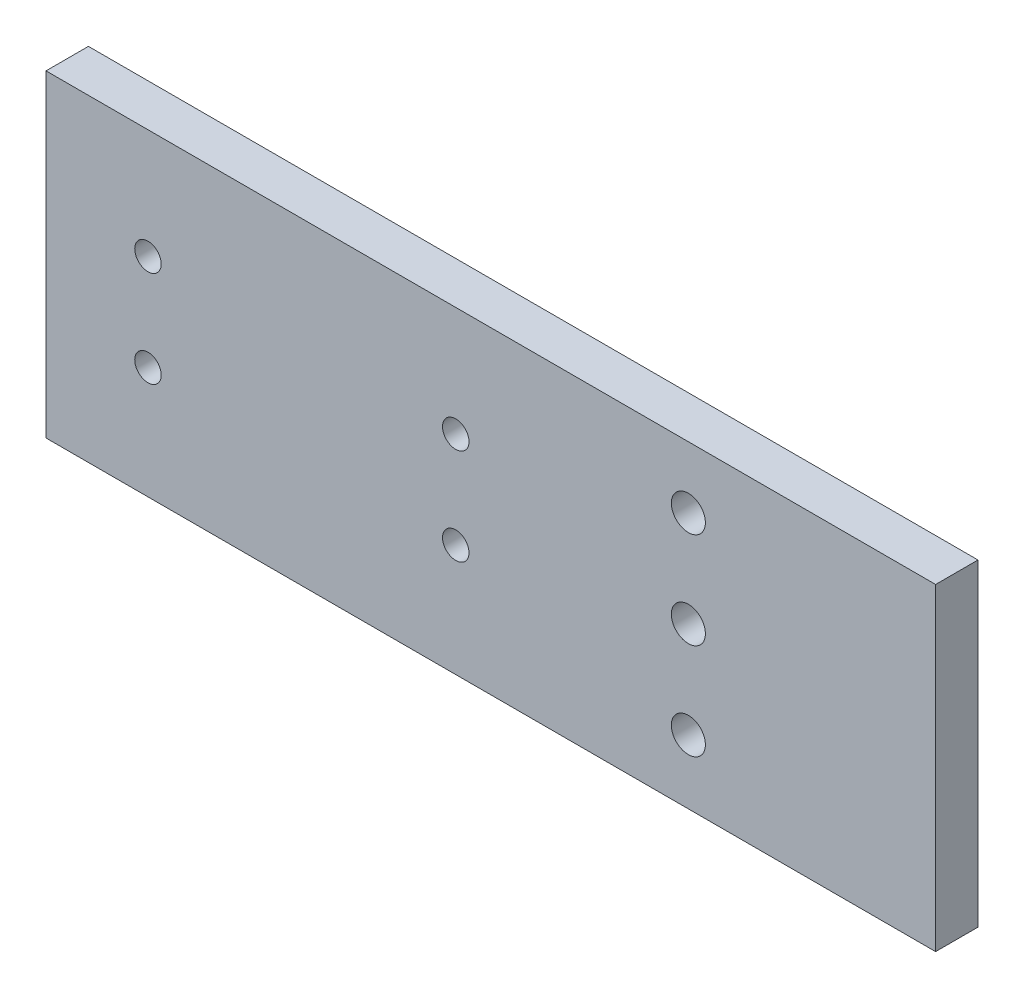
ISO-10303-21;
HEADER;
FILE_DESCRIPTION(('STEP AP214'),'2;1');
FILE_NAME('part.step','',(''),(''),'','','');
FILE_SCHEMA(('AUTOMOTIVE_DESIGN { 1 0 10303 214 1 1 1 1 }'));
ENDSEC;
DATA;
#1=APPLICATION_CONTEXT('core data for automotive mechanical design processes');
#2=APPLICATION_PROTOCOL_DEFINITION('international standard','automotive_design',2000,#1);
#3=PRODUCT_CONTEXT('',#1,'mechanical');
#4=PRODUCT('Part','Part','',(#3));
#5=PRODUCT_RELATED_PRODUCT_CATEGORY('part','',(#4));
#6=PRODUCT_DEFINITION_FORMATION('','',#4);
#7=PRODUCT_DEFINITION_CONTEXT('part definition',#1,'design');
#8=PRODUCT_DEFINITION('design','',#6,#7);
#9=PRODUCT_DEFINITION_SHAPE('','',#8);
#10=(LENGTH_UNIT() NAMED_UNIT(*) SI_UNIT(.MILLI.,.METRE.));
#11=(NAMED_UNIT(*) PLANE_ANGLE_UNIT() SI_UNIT($,.RADIAN.));
#12=(NAMED_UNIT(*) SI_UNIT($,.STERADIAN.) SOLID_ANGLE_UNIT());
#13=UNCERTAINTY_MEASURE_WITH_UNIT(LENGTH_MEASURE(1.E-05),#10,'distance_accuracy_value','');
#14=(GEOMETRIC_REPRESENTATION_CONTEXT(3) GLOBAL_UNCERTAINTY_ASSIGNED_CONTEXT((#13)) GLOBAL_UNIT_ASSIGNED_CONTEXT((#10,
#11,#12)) REPRESENTATION_CONTEXT('',''));
#15=CARTESIAN_POINT('',(0.,0.,0.));
#16=DIRECTION('',(0.,0.,1.));
#17=DIRECTION('',(1.,0.,0.));
#18=AXIS2_PLACEMENT_3D('',#15,#16,#17);
#19=CARTESIAN_POINT('',(25.5,104.09999847412,0.));
#20=DIRECTION('',(0.,0.,1.));
#21=DIRECTION('',(1.,0.,0.));
#22=AXIS2_PLACEMENT_3D('',#19,#20,#21);
#23=PLANE('',#22);
#24=CARTESIAN_POINT('',(42.46900066,110.871,0.));
#25=DIRECTION('',(0.,0.,-1.));
#26=DIRECTION('',(-1.,0.,0.));
#27=AXIS2_PLACEMENT_3D('',#24,#25,#26);
#28=CIRCLE('',#27,0.4499991);
#29=CARTESIAN_POINT('',(42.01900156,110.871,0.));
#30=VERTEX_POINT('',#29);
#31=EDGE_CURVE('P0_E98',#30,#30,#28,.F.);
#32=ORIENTED_EDGE('',*,*,#31,.F.);
#33=EDGE_LOOP('',(#32));
#34=FACE_BOUND('',#33,.T.);
#35=CARTESIAN_POINT('',(36.32399898,109.601,0.));
#36=DIRECTION('',(0.,0.,-1.));
#37=DIRECTION('',(-1.,0.,0.));
#38=AXIS2_PLACEMENT_3D('',#35,#36,#37);
#39=CIRCLE('',#38,0.3499993);
#40=CARTESIAN_POINT('',(35.97399968,109.601,0.));
#41=VERTEX_POINT('',#40);
#42=EDGE_CURVE('P0_E102',#41,#41,#39,.F.);
#43=ORIENTED_EDGE('',*,*,#42,.F.);
#44=EDGE_LOOP('',(#43));
#45=FACE_BOUND('',#44,.T.);
#46=CARTESIAN_POINT('',(42.46900066,105.791,0.));
#47=DIRECTION('',(0.,0.,-1.));
#48=DIRECTION('',(-1.,0.,0.));
#49=AXIS2_PLACEMENT_3D('',#46,#47,#48);
#50=CIRCLE('',#49,0.4499991);
#51=CARTESIAN_POINT('',(42.01900156,105.791,0.));
#52=VERTEX_POINT('',#51);
#53=EDGE_CURVE('P0_E105',#52,#52,#50,.F.);
#54=ORIENTED_EDGE('',*,*,#53,.F.);
#55=EDGE_LOOP('',(#54));
#56=FACE_BOUND('',#55,.T.);
#57=CARTESIAN_POINT('',(42.46900066,108.331,0.));
#58=DIRECTION('',(0.,0.,-1.));
#59=DIRECTION('',(-1.,0.,0.));
#60=AXIS2_PLACEMENT_3D('',#57,#58,#59);
#61=CIRCLE('',#60,0.4499991);
#62=CARTESIAN_POINT('',(42.01900156,108.331,0.));
#63=VERTEX_POINT('',#62);
#64=EDGE_CURVE('P0_E108',#63,#63,#61,.F.);
#65=ORIENTED_EDGE('',*,*,#64,.F.);
#66=EDGE_LOOP('',(#65));
#67=FACE_BOUND('',#66,.T.);
#68=CARTESIAN_POINT('',(36.32399898,107.061,0.));
#69=DIRECTION('',(0.,0.,-1.));
#70=DIRECTION('',(-1.,0.,0.));
#71=AXIS2_PLACEMENT_3D('',#68,#69,#70);
#72=CIRCLE('',#71,0.3499993);
#73=CARTESIAN_POINT('',(35.97399968,107.061,0.));
#74=VERTEX_POINT('',#73);
#75=EDGE_CURVE('P0_E111',#74,#74,#72,.F.);
#76=ORIENTED_EDGE('',*,*,#75,.F.);
#77=EDGE_LOOP('',(#76));
#78=FACE_BOUND('',#77,.T.);
#79=CARTESIAN_POINT('',(28.194,109.601,0.));
#80=DIRECTION('',(0.,0.,-1.));
#81=DIRECTION('',(-1.,0.,0.));
#82=AXIS2_PLACEMENT_3D('',#79,#80,#81);
#83=CIRCLE('',#82,0.3499993);
#84=CARTESIAN_POINT('',(27.8440007,109.601,0.));
#85=VERTEX_POINT('',#84);
#86=EDGE_CURVE('P0_E113',#85,#85,#83,.F.);
#87=ORIENTED_EDGE('',*,*,#86,.F.);
#88=EDGE_LOOP('',(#87));
#89=FACE_BOUND('',#88,.T.);
#90=CARTESIAN_POINT('',(28.194,107.061,0.));
#91=DIRECTION('',(0.,0.,-1.));
#92=DIRECTION('',(-1.,0.,0.));
#93=AXIS2_PLACEMENT_3D('',#90,#91,#92);
#94=CIRCLE('',#93,0.3499993);
#95=CARTESIAN_POINT('',(27.8440007,107.061,0.));
#96=VERTEX_POINT('',#95);
#97=EDGE_CURVE('P0_E19',#96,#96,#94,.F.);
#98=ORIENTED_EDGE('',*,*,#97,.F.);
#99=EDGE_LOOP('',(#98));
#100=FACE_BOUND('',#99,.T.);
#101=DIRECTION('',(1.,0.,0.));
#102=VECTOR('',#101,1.);
#103=CARTESIAN_POINT('',(49.,112.5,0.));
#104=LINE('',#103,#102);
#105=CARTESIAN_POINT('',(25.5,112.5,0.));
#106=VERTEX_POINT('',#105);
#107=CARTESIAN_POINT('',(49.,112.5,0.));
#108=VERTEX_POINT('',#107);
#109=EDGE_CURVE('P0_E69',#106,#108,#104,.T.);
#110=ORIENTED_EDGE('',*,*,#109,.F.);
#111=DIRECTION('',(0.,1.,0.));
#112=VECTOR('',#111,1.);
#113=CARTESIAN_POINT('',(25.5,112.5,0.));
#114=LINE('',#113,#112);
#115=CARTESIAN_POINT('',(25.5,104.09999847412,0.));
#116=VERTEX_POINT('',#115);
#117=EDGE_CURVE('P0_E54',#116,#106,#114,.T.);
#118=ORIENTED_EDGE('',*,*,#117,.F.);
#119=DIRECTION('',(1.,0.,0.));
#120=VECTOR('',#119,1.);
#121=CARTESIAN_POINT('',(25.5,104.09999847412,0.));
#122=LINE('',#121,#120);
#123=CARTESIAN_POINT('',(49.,104.09999847412,0.));
#124=VERTEX_POINT('',#123);
#125=EDGE_CURVE('P0_E59',#124,#116,#122,.F.);
#126=ORIENTED_EDGE('',*,*,#125,.F.);
#127=DIRECTION('',(0.,1.,0.));
#128=VECTOR('',#127,1.);
#129=CARTESIAN_POINT('',(49.,104.09999847412,0.));
#130=LINE('',#129,#128);
#131=EDGE_CURVE('P0_E118',#108,#124,#130,.F.);
#132=ORIENTED_EDGE('',*,*,#131,.F.);
#133=EDGE_LOOP('',(#110,#118,#126,#132));
#134=FACE_BOUND('',#133,.T.);
#135=ADVANCED_FACE('P0_F16',(#34,#45,#56,#67,#78,#89,#100,#134),#23,.T.);
#136=CARTESIAN_POINT('',(25.5,104.09999847412,-1.12000538));
#137=DIRECTION('',(0.,-1.,0.));
#138=DIRECTION('',(0.,0.,-1.));
#139=AXIS2_PLACEMENT_3D('',#136,#137,#138);
#140=PLANE('',#139);
#141=DIRECTION('',(0.,0.,-1.));
#142=VECTOR('',#141,1.);
#143=CARTESIAN_POINT('',(49.,104.09999847412,-1.12000538));
#144=LINE('',#143,#142);
#145=CARTESIAN_POINT('',(49.,104.09999847412,-1.12000538));
#146=VERTEX_POINT('',#145);
#147=EDGE_CURVE('P0_E64',#124,#146,#144,.T.);
#148=ORIENTED_EDGE('',*,*,#147,.F.);
#149=ORIENTED_EDGE('',*,*,#125,.T.);
#150=DIRECTION('',(0.,0.,1.));
#151=VECTOR('',#150,1.);
#152=CARTESIAN_POINT('',(25.5,104.09999847412,-1.12000538));
#153=LINE('',#152,#151);
#154=CARTESIAN_POINT('',(25.5,104.09999847412,-1.12000538));
#155=VERTEX_POINT('',#154);
#156=EDGE_CURVE('P0_E61',#155,#116,#153,.T.);
#157=ORIENTED_EDGE('',*,*,#156,.F.);
#158=DIRECTION('',(-1.,0.,0.));
#159=VECTOR('',#158,1.);
#160=CARTESIAN_POINT('',(25.5,104.09999847412,-1.12000538));
#161=LINE('',#160,#159);
#162=EDGE_CURVE('P0_E101',#146,#155,#161,.T.);
#163=ORIENTED_EDGE('',*,*,#162,.F.);
#164=EDGE_LOOP('',(#148,#149,#157,#163));
#165=FACE_BOUND('',#164,.T.);
#166=ADVANCED_FACE('P0_F60',(#165),#140,.T.);
#167=CARTESIAN_POINT('',(25.5,112.5,-1.12000538));
#168=DIRECTION('',(-1.,0.,0.));
#169=DIRECTION('',(0.,0.,1.));
#170=AXIS2_PLACEMENT_3D('',#167,#168,#169);
#171=PLANE('',#170);
#172=ORIENTED_EDGE('',*,*,#156,.T.);
#173=ORIENTED_EDGE('',*,*,#117,.T.);
#174=DIRECTION('',(0.,0.,1.));
#175=VECTOR('',#174,1.);
#176=CARTESIAN_POINT('',(25.5,112.5,-1.12000538));
#177=LINE('',#176,#175);
#178=CARTESIAN_POINT('',(25.5,112.5,-1.12000538));
#179=VERTEX_POINT('',#178);
#180=EDGE_CURVE('P0_E71',#179,#106,#177,.T.);
#181=ORIENTED_EDGE('',*,*,#180,.F.);
#182=DIRECTION('',(0.,1.,0.));
#183=VECTOR('',#182,1.);
#184=CARTESIAN_POINT('',(25.5,104.09999847412,-1.12000538));
#185=LINE('',#184,#183);
#186=EDGE_CURVE('P0_E75',#155,#179,#185,.T.);
#187=ORIENTED_EDGE('',*,*,#186,.F.);
#188=EDGE_LOOP('',(#172,#173,#181,#187));
#189=FACE_BOUND('',#188,.T.);
#190=ADVANCED_FACE('P0_F73',(#189),#171,.T.);
#191=CARTESIAN_POINT('',(49.,112.5,-1.12000538));
#192=DIRECTION('',(0.,1.,0.));
#193=DIRECTION('',(0.,0.,1.));
#194=AXIS2_PLACEMENT_3D('',#191,#192,#193);
#195=PLANE('',#194);
#196=ORIENTED_EDGE('',*,*,#180,.T.);
#197=ORIENTED_EDGE('',*,*,#109,.T.);
#198=DIRECTION('',(0.,0.,-1.));
#199=VECTOR('',#198,1.);
#200=CARTESIAN_POINT('',(49.,112.5,-1.12000538));
#201=LINE('',#200,#199);
#202=CARTESIAN_POINT('',(49.,112.5,-1.12000538));
#203=VERTEX_POINT('',#202);
#204=EDGE_CURVE('P0_E34',#203,#108,#201,.F.);
#205=ORIENTED_EDGE('',*,*,#204,.F.);
#206=DIRECTION('',(-1.,0.,0.));
#207=VECTOR('',#206,1.);
#208=CARTESIAN_POINT('',(25.5,112.5,-1.12000538));
#209=LINE('',#208,#207);
#210=EDGE_CURVE('P0_E130',#179,#203,#209,.F.);
#211=ORIENTED_EDGE('',*,*,#210,.F.);
#212=EDGE_LOOP('',(#196,#197,#205,#211));
#213=FACE_BOUND('',#212,.T.);
#214=ADVANCED_FACE('P0_F128',(#213),#195,.T.);
#215=CARTESIAN_POINT('',(49.,104.09999847412,-1.12000538));
#216=DIRECTION('',(1.,0.,0.));
#217=DIRECTION('',(0.,0.,-1.));
#218=AXIS2_PLACEMENT_3D('',#215,#216,#217);
#219=PLANE('',#218);
#220=ORIENTED_EDGE('',*,*,#204,.T.);
#221=ORIENTED_EDGE('',*,*,#131,.T.);
#222=ORIENTED_EDGE('',*,*,#147,.T.);
#223=DIRECTION('',(0.,1.,0.));
#224=VECTOR('',#223,1.);
#225=CARTESIAN_POINT('',(49.,104.09999847412,-1.12000538));
#226=LINE('',#225,#224);
#227=EDGE_CURVE('P0_E97',#203,#146,#226,.F.);
#228=ORIENTED_EDGE('',*,*,#227,.F.);
#229=EDGE_LOOP('',(#220,#221,#222,#228));
#230=FACE_BOUND('',#229,.T.);
#231=ADVANCED_FACE('P0_F136',(#230),#219,.T.);
#232=CARTESIAN_POINT('',(28.194,107.061,-1.12000538));
#233=DIRECTION('',(0.,0.,-1.));
#234=DIRECTION('',(-1.,0.,0.));
#235=AXIS2_PLACEMENT_3D('',#232,#233,#234);
#236=CYLINDRICAL_SURFACE('',#235,0.3499993);
#237=CARTESIAN_POINT('',(28.194,107.061,-1.12000538));
#238=DIRECTION('',(0.,0.,-1.));
#239=DIRECTION('',(-1.,0.,0.));
#240=AXIS2_PLACEMENT_3D('',#237,#238,#239);
#241=CIRCLE('',#240,0.3499993);
#242=CARTESIAN_POINT('',(27.8440007,107.061,-1.12000538));
#243=VERTEX_POINT('',#242);
#244=EDGE_CURVE('P0_E94',#243,#243,#241,.F.);
#245=ORIENTED_EDGE('',*,*,#244,.F.);
#246=EDGE_LOOP('',(#245));
#247=FACE_BOUND('',#246,.T.);
#248=ORIENTED_EDGE('',*,*,#97,.T.);
#249=EDGE_LOOP('',(#248));
#250=FACE_BOUND('',#249,.T.);
#251=ADVANCED_FACE('P0_F138',(#247,#250),#236,.F.);
#252=CARTESIAN_POINT('',(28.194,109.601,-1.12000538));
#253=DIRECTION('',(0.,0.,-1.));
#254=DIRECTION('',(-1.,0.,0.));
#255=AXIS2_PLACEMENT_3D('',#252,#253,#254);
#256=CYLINDRICAL_SURFACE('',#255,0.3499993);
#257=CARTESIAN_POINT('',(28.194,109.601,-1.12000538));
#258=DIRECTION('',(0.,0.,-1.));
#259=DIRECTION('',(-1.,0.,0.));
#260=AXIS2_PLACEMENT_3D('',#257,#258,#259);
#261=CIRCLE('',#260,0.3499993);
#262=CARTESIAN_POINT('',(27.8440007,109.601,-1.12000538));
#263=VERTEX_POINT('',#262);
#264=EDGE_CURVE('P0_E91',#263,#263,#261,.F.);
#265=ORIENTED_EDGE('',*,*,#264,.F.);
#266=EDGE_LOOP('',(#265));
#267=FACE_BOUND('',#266,.T.);
#268=ORIENTED_EDGE('',*,*,#86,.T.);
#269=EDGE_LOOP('',(#268));
#270=FACE_BOUND('',#269,.T.);
#271=ADVANCED_FACE('P0_F145',(#267,#270),#256,.F.);
#272=CARTESIAN_POINT('',(36.32399898,107.061,-1.12000538));
#273=DIRECTION('',(0.,0.,-1.));
#274=DIRECTION('',(-1.,0.,0.));
#275=AXIS2_PLACEMENT_3D('',#272,#273,#274);
#276=CYLINDRICAL_SURFACE('',#275,0.3499993);
#277=CARTESIAN_POINT('',(36.32399898,107.061,-1.12000538));
#278=DIRECTION('',(0.,0.,-1.));
#279=DIRECTION('',(-1.,0.,0.));
#280=AXIS2_PLACEMENT_3D('',#277,#278,#279);
#281=CIRCLE('',#280,0.3499993);
#282=CARTESIAN_POINT('',(35.97399968,107.061,-1.12000538));
#283=VERTEX_POINT('',#282);
#284=EDGE_CURVE('P0_E88',#283,#283,#281,.F.);
#285=ORIENTED_EDGE('',*,*,#284,.F.);
#286=EDGE_LOOP('',(#285));
#287=FACE_BOUND('',#286,.T.);
#288=ORIENTED_EDGE('',*,*,#75,.T.);
#289=EDGE_LOOP('',(#288));
#290=FACE_BOUND('',#289,.T.);
#291=ADVANCED_FACE('P0_F171',(#287,#290),#276,.F.);
#292=CARTESIAN_POINT('',(42.46900066,108.331,-1.12000538));
#293=DIRECTION('',(0.,0.,-1.));
#294=DIRECTION('',(-1.,0.,0.));
#295=AXIS2_PLACEMENT_3D('',#292,#293,#294);
#296=CYLINDRICAL_SURFACE('',#295,0.4499991);
#297=CARTESIAN_POINT('',(42.46900066,108.331,-1.12000538));
#298=DIRECTION('',(0.,0.,-1.));
#299=DIRECTION('',(-1.,0.,0.));
#300=AXIS2_PLACEMENT_3D('',#297,#298,#299);
#301=CIRCLE('',#300,0.4499991);
#302=CARTESIAN_POINT('',(42.01900156,108.331,-1.12000538));
#303=VERTEX_POINT('',#302);
#304=EDGE_CURVE('P0_E85',#303,#303,#301,.F.);
#305=ORIENTED_EDGE('',*,*,#304,.F.);
#306=EDGE_LOOP('',(#305));
#307=FACE_BOUND('',#306,.T.);
#308=ORIENTED_EDGE('',*,*,#64,.T.);
#309=EDGE_LOOP('',(#308));
#310=FACE_BOUND('',#309,.T.);
#311=ADVANCED_FACE('P0_F167',(#307,#310),#296,.F.);
#312=CARTESIAN_POINT('',(42.46900066,105.791,-1.12000538));
#313=DIRECTION('',(0.,0.,-1.));
#314=DIRECTION('',(-1.,0.,0.));
#315=AXIS2_PLACEMENT_3D('',#312,#313,#314);
#316=CYLINDRICAL_SURFACE('',#315,0.4499991);
#317=CARTESIAN_POINT('',(42.46900066,105.791,-1.12000538));
#318=DIRECTION('',(0.,0.,-1.));
#319=DIRECTION('',(-1.,0.,0.));
#320=AXIS2_PLACEMENT_3D('',#317,#318,#319);
#321=CIRCLE('',#320,0.4499991);
#322=CARTESIAN_POINT('',(42.01900156,105.791,-1.12000538));
#323=VERTEX_POINT('',#322);
#324=EDGE_CURVE('P0_E82',#323,#323,#321,.F.);
#325=ORIENTED_EDGE('',*,*,#324,.F.);
#326=EDGE_LOOP('',(#325));
#327=FACE_BOUND('',#326,.T.);
#328=ORIENTED_EDGE('',*,*,#53,.T.);
#329=EDGE_LOOP('',(#328));
#330=FACE_BOUND('',#329,.T.);
#331=ADVANCED_FACE('P0_F163',(#327,#330),#316,.F.);
#332=CARTESIAN_POINT('',(36.32399898,109.601,-1.12000538));
#333=DIRECTION('',(0.,0.,-1.));
#334=DIRECTION('',(-1.,0.,0.));
#335=AXIS2_PLACEMENT_3D('',#332,#333,#334);
#336=CYLINDRICAL_SURFACE('',#335,0.3499993);
#337=CARTESIAN_POINT('',(36.32399898,109.601,-1.12000538));
#338=DIRECTION('',(0.,0.,-1.));
#339=DIRECTION('',(-1.,0.,0.));
#340=AXIS2_PLACEMENT_3D('',#337,#338,#339);
#341=CIRCLE('',#340,0.3499993);
#342=CARTESIAN_POINT('',(35.97399968,109.601,-1.12000538));
#343=VERTEX_POINT('',#342);
#344=EDGE_CURVE('P0_E25',#343,#343,#341,.F.);
#345=ORIENTED_EDGE('',*,*,#344,.F.);
#346=EDGE_LOOP('',(#345));
#347=FACE_BOUND('',#346,.T.);
#348=ORIENTED_EDGE('',*,*,#42,.T.);
#349=EDGE_LOOP('',(#348));
#350=FACE_BOUND('',#349,.T.);
#351=ADVANCED_FACE('P0_F156',(#347,#350),#336,.F.);
#352=CARTESIAN_POINT('',(42.46900066,110.871,-1.12000538));
#353=DIRECTION('',(0.,0.,-1.));
#354=DIRECTION('',(-1.,0.,0.));
#355=AXIS2_PLACEMENT_3D('',#352,#353,#354);
#356=CYLINDRICAL_SURFACE('',#355,0.4499991);
#357=CARTESIAN_POINT('',(42.46900066,110.871,-1.12000538));
#358=DIRECTION('',(0.,0.,-1.));
#359=DIRECTION('',(-1.,0.,0.));
#360=AXIS2_PLACEMENT_3D('',#357,#358,#359);
#361=CIRCLE('',#360,0.4499991);
#362=CARTESIAN_POINT('',(42.01900156,110.871,-1.12000538));
#363=VERTEX_POINT('',#362);
#364=EDGE_CURVE('P0_E10',#363,#363,#361,.F.);
#365=ORIENTED_EDGE('',*,*,#364,.F.);
#366=EDGE_LOOP('',(#365));
#367=FACE_BOUND('',#366,.T.);
#368=ORIENTED_EDGE('',*,*,#31,.T.);
#369=EDGE_LOOP('',(#368));
#370=FACE_BOUND('',#369,.T.);
#371=ADVANCED_FACE('P0_F150',(#367,#370),#356,.F.);
#372=CARTESIAN_POINT('',(25.5,104.09999847412,-1.12000538));
#373=DIRECTION('',(0.,0.,-1.));
#374=DIRECTION('',(-1.,0.,0.));
#375=AXIS2_PLACEMENT_3D('',#372,#373,#374);
#376=PLANE('',#375);
#377=ORIENTED_EDGE('',*,*,#364,.T.);
#378=EDGE_LOOP('',(#377));
#379=FACE_BOUND('',#378,.T.);
#380=ORIENTED_EDGE('',*,*,#344,.T.);
#381=EDGE_LOOP('',(#380));
#382=FACE_BOUND('',#381,.T.);
#383=ORIENTED_EDGE('',*,*,#324,.T.);
#384=EDGE_LOOP('',(#383));
#385=FACE_BOUND('',#384,.T.);
#386=ORIENTED_EDGE('',*,*,#304,.T.);
#387=EDGE_LOOP('',(#386));
#388=FACE_BOUND('',#387,.T.);
#389=ORIENTED_EDGE('',*,*,#284,.T.);
#390=EDGE_LOOP('',(#389));
#391=FACE_BOUND('',#390,.T.);
#392=ORIENTED_EDGE('',*,*,#264,.T.);
#393=EDGE_LOOP('',(#392));
#394=FACE_BOUND('',#393,.T.);
#395=ORIENTED_EDGE('',*,*,#244,.T.);
#396=EDGE_LOOP('',(#395));
#397=FACE_BOUND('',#396,.T.);
#398=ORIENTED_EDGE('',*,*,#210,.T.);
#399=ORIENTED_EDGE('',*,*,#227,.T.);
#400=ORIENTED_EDGE('',*,*,#162,.T.);
#401=ORIENTED_EDGE('',*,*,#186,.T.);
#402=EDGE_LOOP('',(#398,#399,#400,#401));
#403=FACE_BOUND('',#402,.T.);
#404=ADVANCED_FACE('P0_F134',(#379,#382,#385,#388,#391,#394,#397,#403),#376,.T.);
#405=CLOSED_SHELL('',(#135,#166,#190,#214,#231,#251,#271,#291,#311,#331,#351,#371,#404));
#406=MANIFOLD_SOLID_BREP('P0_B1',#405);
#407=CARTESIAN_POINT('',(32.87499952,108.87500184587,-2.420004367828));
#408=DIRECTION('',(0.,1.,0.));
#409=DIRECTION('',(0.,0.,1.));
#410=AXIS2_PLACEMENT_3D('',#407,#408,#409);
#411=PLANE('',#410);
#412=DIRECTION('',(0.,0.,1.));
#413=VECTOR('',#412,1.);
#414=CARTESIAN_POINT('',(31.12500048,108.87500184587,-2.420004367828));
#415=LINE('',#414,#413);
#416=CARTESIAN_POINT('',(31.12500048,108.87500184587,-1.120004427828));
#417=VERTEX_POINT('',#416);
#418=CARTESIAN_POINT('',(31.12500048,108.87500184587,-2.420004367828));
#419=VERTEX_POINT('',#418);
#420=EDGE_CURVE('P1_E20',#417,#419,#415,.F.);
#421=ORIENTED_EDGE('',*,*,#420,.F.);
#422=DIRECTION('',(1.,0.,0.));
#423=VECTOR('',#422,1.);
#424=CARTESIAN_POINT('',(31.12500048,108.87500184587,-1.120004427828));
#425=LINE('',#424,#423);
#426=CARTESIAN_POINT('',(32.87499952,108.87500184587,-1.120004427828));
#427=VERTEX_POINT('',#426);
#428=EDGE_CURVE('P1_E80',#427,#417,#425,.F.);
#429=ORIENTED_EDGE('',*,*,#428,.F.);
#430=DIRECTION('',(0.,0.,-1.));
#431=VECTOR('',#430,1.);
#432=CARTESIAN_POINT('',(32.87499952,108.87500184587,-2.420004367828));
#433=LINE('',#432,#431);
#434=CARTESIAN_POINT('',(32.87499952,108.87500184587,-2.420004367828));
#435=VERTEX_POINT('',#434);
#436=EDGE_CURVE('P1_E68',#435,#427,#433,.F.);
#437=ORIENTED_EDGE('',*,*,#436,.F.);
#438=DIRECTION('',(-1.,0.,0.));
#439=VECTOR('',#438,1.);
#440=CARTESIAN_POINT('',(31.12500048,108.87500184587,-2.420004367828));
#441=LINE('',#440,#439);
#442=EDGE_CURVE('P1_E55',#419,#435,#441,.F.);
#443=ORIENTED_EDGE('',*,*,#442,.F.);
#444=EDGE_LOOP('',(#421,#429,#437,#443));
#445=FACE_BOUND('',#444,.T.);
#446=ADVANCED_FACE('P1_F17',(#445),#411,.T.);
#447=CARTESIAN_POINT('',(31.12500048,108.87500184587,-2.420004367828));
#448=DIRECTION('',(-1.,0.,0.));
#449=DIRECTION('',(0.,0.,1.));
#450=AXIS2_PLACEMENT_3D('',#447,#448,#449);
#451=PLANE('',#450);
#452=DIRECTION('',(0.,0.,-1.));
#453=VECTOR('',#452,1.);
#454=CARTESIAN_POINT('',(31.12500048,107.92500120587,-2.420004367828));
#455=LINE('',#454,#453);
#456=CARTESIAN_POINT('',(31.12500048,107.92500120587,-1.120004427828));
#457=VERTEX_POINT('',#456);
#458=CARTESIAN_POINT('',(31.12500048,107.92500120587,-2.420004367828));
#459=VERTEX_POINT('',#458);
#460=EDGE_CURVE('P1_E83',#457,#459,#455,.T.);
#461=ORIENTED_EDGE('',*,*,#460,.F.);
#462=DIRECTION('',(0.,1.,0.));
#463=VECTOR('',#462,1.);
#464=CARTESIAN_POINT('',(31.12500048,107.92500120587,-1.120004427828));
#465=LINE('',#464,#463);
#466=EDGE_CURVE('P1_E64',#417,#457,#465,.F.);
#467=ORIENTED_EDGE('',*,*,#466,.F.);
#468=ORIENTED_EDGE('',*,*,#420,.T.);
#469=DIRECTION('',(0.,1.,0.));
#470=VECTOR('',#469,1.);
#471=CARTESIAN_POINT('',(31.12500048,107.92500120587,-2.420004367828));
#472=LINE('',#471,#470);
#473=EDGE_CURVE('P1_E61',#459,#419,#472,.T.);
#474=ORIENTED_EDGE('',*,*,#473,.F.);
#475=EDGE_LOOP('',(#461,#467,#468,#474));
#476=FACE_BOUND('',#475,.T.);
#477=ADVANCED_FACE('P1_F60',(#476),#451,.T.);
#478=CARTESIAN_POINT('',(31.12500048,107.92500120587,-2.420004367828));
#479=DIRECTION('',(0.,0.,-1.));
#480=DIRECTION('',(-1.,0.,0.));
#481=AXIS2_PLACEMENT_3D('',#478,#479,#480);
#482=PLANE('',#481);
#483=ORIENTED_EDGE('',*,*,#442,.T.);
#484=DIRECTION('',(0.,1.,0.));
#485=VECTOR('',#484,1.);
#486=CARTESIAN_POINT('',(32.87499952,107.92500120587,-2.420004367828));
#487=LINE('',#486,#485);
#488=CARTESIAN_POINT('',(32.87499952,107.92500120587,-2.420004367828));
#489=VERTEX_POINT('',#488);
#490=EDGE_CURVE('P1_E70',#489,#435,#487,.T.);
#491=ORIENTED_EDGE('',*,*,#490,.F.);
#492=DIRECTION('',(1.,0.,0.));
#493=VECTOR('',#492,1.);
#494=CARTESIAN_POINT('',(31.12500048,107.92500120587,-2.420004367828));
#495=LINE('',#494,#493);
#496=EDGE_CURVE('P1_E74',#459,#489,#495,.T.);
#497=ORIENTED_EDGE('',*,*,#496,.F.);
#498=ORIENTED_EDGE('',*,*,#473,.T.);
#499=EDGE_LOOP('',(#483,#491,#497,#498));
#500=FACE_BOUND('',#499,.T.);
#501=ADVANCED_FACE('P1_F72',(#500),#482,.T.);
#502=CARTESIAN_POINT('',(32.87499952,107.92500120587,-2.420004367828));
#503=DIRECTION('',(1.,0.,0.));
#504=DIRECTION('',(0.,0.,-1.));
#505=AXIS2_PLACEMENT_3D('',#502,#503,#504);
#506=PLANE('',#505);
#507=ORIENTED_EDGE('',*,*,#436,.T.);
#508=DIRECTION('',(0.,1.,0.));
#509=VECTOR('',#508,1.);
#510=CARTESIAN_POINT('',(32.87499952,107.92500120587,-1.120004427828));
#511=LINE('',#510,#509);
#512=CARTESIAN_POINT('',(32.87499952,107.92500120587,-1.120004427828));
#513=VERTEX_POINT('',#512);
#514=EDGE_CURVE('P1_E35',#513,#427,#511,.T.);
#515=ORIENTED_EDGE('',*,*,#514,.F.);
#516=DIRECTION('',(0.,0.,-1.));
#517=VECTOR('',#516,1.);
#518=CARTESIAN_POINT('',(32.87499952,107.92500120587,-2.420004367828));
#519=LINE('',#518,#517);
#520=EDGE_CURVE('P1_E26',#489,#513,#519,.F.);
#521=ORIENTED_EDGE('',*,*,#520,.F.);
#522=ORIENTED_EDGE('',*,*,#490,.T.);
#523=EDGE_LOOP('',(#507,#515,#521,#522));
#524=FACE_BOUND('',#523,.T.);
#525=ADVANCED_FACE('P1_F89',(#524),#506,.T.);
#526=CARTESIAN_POINT('',(31.12500048,107.92500120587,-1.120004427828));
#527=DIRECTION('',(0.,0.,1.));
#528=DIRECTION('',(1.,0.,0.));
#529=AXIS2_PLACEMENT_3D('',#526,#527,#528);
#530=PLANE('',#529);
#531=ORIENTED_EDGE('',*,*,#428,.T.);
#532=ORIENTED_EDGE('',*,*,#466,.T.);
#533=DIRECTION('',(1.,0.,0.));
#534=VECTOR('',#533,1.);
#535=CARTESIAN_POINT('',(31.12500048,107.92500120587,-1.120004427828));
#536=LINE('',#535,#534);
#537=EDGE_CURVE('P1_E11',#513,#457,#536,.F.);
#538=ORIENTED_EDGE('',*,*,#537,.F.);
#539=ORIENTED_EDGE('',*,*,#514,.T.);
#540=EDGE_LOOP('',(#531,#532,#538,#539));
#541=FACE_BOUND('',#540,.T.);
#542=ADVANCED_FACE('P1_F91',(#541),#530,.T.);
#543=CARTESIAN_POINT('',(31.12500048,107.92500120587,-2.420004367828));
#544=DIRECTION('',(0.,-1.,0.));
#545=DIRECTION('',(0.,0.,-1.));
#546=AXIS2_PLACEMENT_3D('',#543,#544,#545);
#547=PLANE('',#546);
#548=ORIENTED_EDGE('',*,*,#520,.T.);
#549=ORIENTED_EDGE('',*,*,#537,.T.);
#550=ORIENTED_EDGE('',*,*,#460,.T.);
#551=ORIENTED_EDGE('',*,*,#496,.T.);
#552=EDGE_LOOP('',(#548,#549,#550,#551));
#553=FACE_BOUND('',#552,.T.);
#554=ADVANCED_FACE('P1_F88',(#553),#547,.T.);
#555=CLOSED_SHELL('',(#446,#477,#501,#525,#542,#554));
#556=MANIFOLD_SOLID_BREP('P1_B1',#555);
#557=CARTESIAN_POINT('',(40.174998757061,107.47500032,-2.420004367828));
#558=DIRECTION('',(0.,1.,0.));
#559=DIRECTION('',(0.,0.,1.));
#560=AXIS2_PLACEMENT_3D('',#557,#558,#559);
#561=PLANE('',#560);
#562=DIRECTION('',(0.,0.,1.));
#563=VECTOR('',#562,1.);
#564=CARTESIAN_POINT('',(38.424999717061,107.47500032,-2.420004367828));
#565=LINE('',#564,#563);
#566=CARTESIAN_POINT('',(38.424999717061,107.47500032,-1.120004427828));
#567=VERTEX_POINT('',#566);
#568=CARTESIAN_POINT('',(38.424999717061,107.47500032,-2.420004367828));
#569=VERTEX_POINT('',#568);
#570=EDGE_CURVE('P2_E20',#567,#569,#565,.F.);
#571=ORIENTED_EDGE('',*,*,#570,.F.);
#572=DIRECTION('',(1.,0.,0.));
#573=VECTOR('',#572,1.);
#574=CARTESIAN_POINT('',(38.424999717061,107.47500032,-1.120004427828));
#575=LINE('',#574,#573);
#576=CARTESIAN_POINT('',(40.174998757061,107.47500032,-1.120004427828));
#577=VERTEX_POINT('',#576);
#578=EDGE_CURVE('P2_E80',#577,#567,#575,.F.);
#579=ORIENTED_EDGE('',*,*,#578,.F.);
#580=DIRECTION('',(0.,0.,-1.));
#581=VECTOR('',#580,1.);
#582=CARTESIAN_POINT('',(40.174998757061,107.47500032,-2.420004367828));
#583=LINE('',#582,#581);
#584=CARTESIAN_POINT('',(40.174998757061,107.47500032,-2.420004367828));
#585=VERTEX_POINT('',#584);
#586=EDGE_CURVE('P2_E68',#585,#577,#583,.F.);
#587=ORIENTED_EDGE('',*,*,#586,.F.);
#588=DIRECTION('',(-1.,0.,0.));
#589=VECTOR('',#588,1.);
#590=CARTESIAN_POINT('',(38.424999717061,107.47500032,-2.420004367828));
#591=LINE('',#590,#589);
#592=EDGE_CURVE('P2_E55',#569,#585,#591,.F.);
#593=ORIENTED_EDGE('',*,*,#592,.F.);
#594=EDGE_LOOP('',(#571,#579,#587,#593));
#595=FACE_BOUND('',#594,.T.);
#596=ADVANCED_FACE('P2_F17',(#595),#561,.T.);
#597=CARTESIAN_POINT('',(38.424999717061,107.47500032,-2.420004367828));
#598=DIRECTION('',(-1.,0.,0.));
#599=DIRECTION('',(0.,0.,1.));
#600=AXIS2_PLACEMENT_3D('',#597,#598,#599);
#601=PLANE('',#600);
#602=DIRECTION('',(0.,0.,-1.));
#603=VECTOR('',#602,1.);
#604=CARTESIAN_POINT('',(38.424999717061,106.52499968,-2.420004367828));
#605=LINE('',#604,#603);
#606=CARTESIAN_POINT('',(38.424999717061,106.52499968,-1.120004427828));
#607=VERTEX_POINT('',#606);
#608=CARTESIAN_POINT('',(38.424999717061,106.52499968,-2.420004367828));
#609=VERTEX_POINT('',#608);
#610=EDGE_CURVE('P2_E83',#607,#609,#605,.T.);
#611=ORIENTED_EDGE('',*,*,#610,.F.);
#612=DIRECTION('',(0.,1.,0.));
#613=VECTOR('',#612,1.);
#614=CARTESIAN_POINT('',(38.424999717061,106.52499968,-1.120004427828));
#615=LINE('',#614,#613);
#616=EDGE_CURVE('P2_E64',#567,#607,#615,.F.);
#617=ORIENTED_EDGE('',*,*,#616,.F.);
#618=ORIENTED_EDGE('',*,*,#570,.T.);
#619=DIRECTION('',(0.,1.,0.));
#620=VECTOR('',#619,1.);
#621=CARTESIAN_POINT('',(38.424999717061,106.52499968,-2.420004367828));
#622=LINE('',#621,#620);
#623=EDGE_CURVE('P2_E61',#609,#569,#622,.T.);
#624=ORIENTED_EDGE('',*,*,#623,.F.);
#625=EDGE_LOOP('',(#611,#617,#618,#624));
#626=FACE_BOUND('',#625,.T.);
#627=ADVANCED_FACE('P2_F60',(#626),#601,.T.);
#628=CARTESIAN_POINT('',(38.424999717061,106.52499968,-2.420004367828));
#629=DIRECTION('',(0.,0.,-1.));
#630=DIRECTION('',(-1.,0.,0.));
#631=AXIS2_PLACEMENT_3D('',#628,#629,#630);
#632=PLANE('',#631);
#633=ORIENTED_EDGE('',*,*,#592,.T.);
#634=DIRECTION('',(0.,1.,0.));
#635=VECTOR('',#634,1.);
#636=CARTESIAN_POINT('',(40.174998757061,106.52499968,-2.420004367828));
#637=LINE('',#636,#635);
#638=CARTESIAN_POINT('',(40.174998757061,106.52499968,-2.420004367828));
#639=VERTEX_POINT('',#638);
#640=EDGE_CURVE('P2_E70',#639,#585,#637,.T.);
#641=ORIENTED_EDGE('',*,*,#640,.F.);
#642=DIRECTION('',(1.,0.,0.));
#643=VECTOR('',#642,1.);
#644=CARTESIAN_POINT('',(38.424999717061,106.52499968,-2.420004367828));
#645=LINE('',#644,#643);
#646=EDGE_CURVE('P2_E74',#609,#639,#645,.T.);
#647=ORIENTED_EDGE('',*,*,#646,.F.);
#648=ORIENTED_EDGE('',*,*,#623,.T.);
#649=EDGE_LOOP('',(#633,#641,#647,#648));
#650=FACE_BOUND('',#649,.T.);
#651=ADVANCED_FACE('P2_F72',(#650),#632,.T.);
#652=CARTESIAN_POINT('',(40.174998757061,106.52499968,-2.420004367828));
#653=DIRECTION('',(1.,0.,0.));
#654=DIRECTION('',(0.,0.,-1.));
#655=AXIS2_PLACEMENT_3D('',#652,#653,#654);
#656=PLANE('',#655);
#657=ORIENTED_EDGE('',*,*,#586,.T.);
#658=DIRECTION('',(0.,1.,0.));
#659=VECTOR('',#658,1.);
#660=CARTESIAN_POINT('',(40.174998757061,106.52499968,-1.120004427828));
#661=LINE('',#660,#659);
#662=CARTESIAN_POINT('',(40.174998757061,106.52499968,-1.120004427828));
#663=VERTEX_POINT('',#662);
#664=EDGE_CURVE('P2_E35',#663,#577,#661,.T.);
#665=ORIENTED_EDGE('',*,*,#664,.F.);
#666=DIRECTION('',(0.,0.,-1.));
#667=VECTOR('',#666,1.);
#668=CARTESIAN_POINT('',(40.174998757061,106.52499968,-2.420004367828));
#669=LINE('',#668,#667);
#670=EDGE_CURVE('P2_E26',#639,#663,#669,.F.);
#671=ORIENTED_EDGE('',*,*,#670,.F.);
#672=ORIENTED_EDGE('',*,*,#640,.T.);
#673=EDGE_LOOP('',(#657,#665,#671,#672));
#674=FACE_BOUND('',#673,.T.);
#675=ADVANCED_FACE('P2_F89',(#674),#656,.T.);
#676=CARTESIAN_POINT('',(38.424999717061,106.52499968,-1.120004427828));
#677=DIRECTION('',(0.,0.,1.));
#678=DIRECTION('',(1.,0.,0.));
#679=AXIS2_PLACEMENT_3D('',#676,#677,#678);
#680=PLANE('',#679);
#681=ORIENTED_EDGE('',*,*,#578,.T.);
#682=ORIENTED_EDGE('',*,*,#616,.T.);
#683=DIRECTION('',(1.,0.,0.));
#684=VECTOR('',#683,1.);
#685=CARTESIAN_POINT('',(38.424999717061,106.52499968,-1.120004427828));
#686=LINE('',#685,#684);
#687=EDGE_CURVE('P2_E11',#663,#607,#686,.F.);
#688=ORIENTED_EDGE('',*,*,#687,.F.);
#689=ORIENTED_EDGE('',*,*,#664,.T.);
#690=EDGE_LOOP('',(#681,#682,#688,#689));
#691=FACE_BOUND('',#690,.T.);
#692=ADVANCED_FACE('P2_F91',(#691),#680,.T.);
#693=CARTESIAN_POINT('',(38.424999717061,106.52499968,-2.420004367828));
#694=DIRECTION('',(0.,-1.,0.));
#695=DIRECTION('',(0.,0.,-1.));
#696=AXIS2_PLACEMENT_3D('',#693,#694,#695);
#697=PLANE('',#696);
#698=ORIENTED_EDGE('',*,*,#670,.T.);
#699=ORIENTED_EDGE('',*,*,#687,.T.);
#700=ORIENTED_EDGE('',*,*,#610,.T.);
#701=ORIENTED_EDGE('',*,*,#646,.T.);
#702=EDGE_LOOP('',(#698,#699,#700,#701));
#703=FACE_BOUND('',#702,.T.);
#704=ADVANCED_FACE('P2_F88',(#703),#697,.T.);
#705=CLOSED_SHELL('',(#596,#627,#651,#675,#692,#704));
#706=MANIFOLD_SOLID_BREP('P2_B1',#705);
#707=ADVANCED_BREP_SHAPE_REPRESENTATION('',(#18,#406,#556,#706),#14);
#708=SHAPE_DEFINITION_REPRESENTATION(#9,#707);
ENDSEC;
END-ISO-10303-21;
